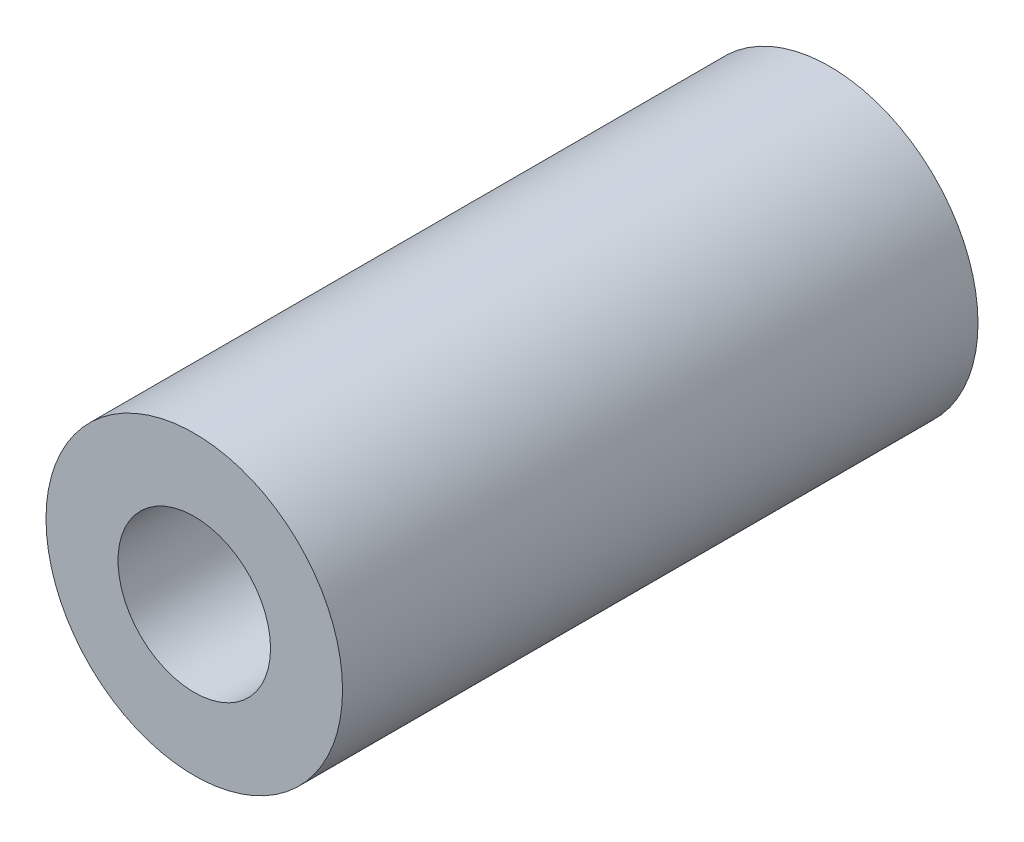
ISO-10303-21;
HEADER;
FILE_DESCRIPTION(('STEP AP214'),'2;1');
FILE_NAME('part.step','',(''),(''),'','','');
FILE_SCHEMA(('AUTOMOTIVE_DESIGN { 1 0 10303 214 1 1 1 1 }'));
ENDSEC;
DATA;
#1=APPLICATION_CONTEXT('core data for automotive mechanical design processes');
#2=APPLICATION_PROTOCOL_DEFINITION('international standard','automotive_design',2000,#1);
#3=PRODUCT_CONTEXT('',#1,'mechanical');
#4=PRODUCT('Part','Part','',(#3));
#5=PRODUCT_RELATED_PRODUCT_CATEGORY('part','',(#4));
#6=PRODUCT_DEFINITION_FORMATION('','',#4);
#7=PRODUCT_DEFINITION_CONTEXT('part definition',#1,'design');
#8=PRODUCT_DEFINITION('design','',#6,#7);
#9=PRODUCT_DEFINITION_SHAPE('','',#8);
#10=(LENGTH_UNIT() NAMED_UNIT(*) SI_UNIT(.MILLI.,.METRE.));
#11=(NAMED_UNIT(*) PLANE_ANGLE_UNIT() SI_UNIT($,.RADIAN.));
#12=(NAMED_UNIT(*) SI_UNIT($,.STERADIAN.) SOLID_ANGLE_UNIT());
#13=UNCERTAINTY_MEASURE_WITH_UNIT(LENGTH_MEASURE(1.E-05),#10,'distance_accuracy_value','');
#14=(GEOMETRIC_REPRESENTATION_CONTEXT(3) GLOBAL_UNCERTAINTY_ASSIGNED_CONTEXT((#13)) GLOBAL_UNIT_ASSIGNED_CONTEXT((#10,
#11,#12)) REPRESENTATION_CONTEXT('',''));
#15=CARTESIAN_POINT('',(0.,0.,0.));
#16=DIRECTION('',(0.,0.,1.));
#17=DIRECTION('',(1.,0.,0.));
#18=AXIS2_PLACEMENT_3D('',#15,#16,#17);
#19=CARTESIAN_POINT('',(0.,0.,15.));
#20=DIRECTION('',(0.,0.,1.));
#21=DIRECTION('',(1.,0.,0.));
#22=AXIS2_PLACEMENT_3D('',#19,#20,#21);
#23=PLANE('',#22);
#24=CARTESIAN_POINT('',(0.,0.,15.));
#25=DIRECTION('',(0.,0.,1.));
#26=DIRECTION('',(1.,0.,0.));
#27=AXIS2_PLACEMENT_3D('',#24,#25,#26);
#28=CIRCLE('',#27,3.5);
#29=CARTESIAN_POINT('',(3.5,0.,15.));
#30=VERTEX_POINT('',#29);
#31=EDGE_CURVE('E10',#30,#30,#28,.T.);
#32=ORIENTED_EDGE('',*,*,#31,.T.);
#33=EDGE_LOOP('',(#32));
#34=FACE_BOUND('',#33,.T.);
#35=CARTESIAN_POINT('',(0.,0.,15.));
#36=DIRECTION('',(0.,0.,1.));
#37=DIRECTION('',(1.,0.,0.));
#38=AXIS2_PLACEMENT_3D('',#35,#36,#37);
#39=CIRCLE('',#38,1.8);
#40=CARTESIAN_POINT('',(1.8,0.,15.));
#41=VERTEX_POINT('',#40);
#42=EDGE_CURVE('E42',#41,#41,#39,.T.);
#43=ORIENTED_EDGE('',*,*,#42,.F.);
#44=EDGE_LOOP('',(#43));
#45=FACE_BOUND('',#44,.T.);
#46=ADVANCED_FACE('F31',(#34,#45),#23,.T.);
#47=CARTESIAN_POINT('',(0.,0.,0.));
#48=DIRECTION('',(0.,0.,1.));
#49=DIRECTION('',(1.,0.,0.));
#50=AXIS2_PLACEMENT_3D('',#47,#48,#49);
#51=PLANE('',#50);
#52=CARTESIAN_POINT('',(0.,0.,0.));
#53=DIRECTION('',(0.,0.,1.));
#54=DIRECTION('',(1.,0.,0.));
#55=AXIS2_PLACEMENT_3D('',#52,#53,#54);
#56=CIRCLE('',#55,3.5);
#57=CARTESIAN_POINT('',(3.5,0.,0.));
#58=VERTEX_POINT('',#57);
#59=EDGE_CURVE('E35',#58,#58,#56,.T.);
#60=ORIENTED_EDGE('',*,*,#59,.F.);
#61=EDGE_LOOP('',(#60));
#62=FACE_BOUND('',#61,.T.);
#63=CARTESIAN_POINT('',(0.,0.,0.));
#64=DIRECTION('',(0.,0.,1.));
#65=DIRECTION('',(1.,0.,0.));
#66=AXIS2_PLACEMENT_3D('',#63,#64,#65);
#67=CIRCLE('',#66,1.8);
#68=CARTESIAN_POINT('',(1.8,0.,0.));
#69=VERTEX_POINT('',#68);
#70=EDGE_CURVE('E44',#69,#69,#67,.T.);
#71=ORIENTED_EDGE('',*,*,#70,.T.);
#72=EDGE_LOOP('',(#71));
#73=FACE_BOUND('',#72,.T.);
#74=ADVANCED_FACE('F54',(#62,#73),#51,.F.);
#75=CARTESIAN_POINT('',(0.,0.,15.));
#76=DIRECTION('',(0.,0.,-1.));
#77=DIRECTION('',(-1.,0.,0.));
#78=AXIS2_PLACEMENT_3D('',#75,#76,#77);
#79=CYLINDRICAL_SURFACE('',#78,3.5);
#80=ORIENTED_EDGE('',*,*,#31,.F.);
#81=EDGE_LOOP('',(#80));
#82=FACE_BOUND('',#81,.T.);
#83=ORIENTED_EDGE('',*,*,#59,.T.);
#84=EDGE_LOOP('',(#83));
#85=FACE_BOUND('',#84,.T.);
#86=ADVANCED_FACE('F33',(#82,#85),#79,.T.);
#87=CARTESIAN_POINT('',(0.,0.,15.));
#88=DIRECTION('',(0.,0.,-1.));
#89=DIRECTION('',(-1.,0.,0.));
#90=AXIS2_PLACEMENT_3D('',#87,#88,#89);
#91=CYLINDRICAL_SURFACE('',#90,1.8);
#92=ORIENTED_EDGE('',*,*,#42,.T.);
#93=EDGE_LOOP('',(#92));
#94=FACE_BOUND('',#93,.T.);
#95=ORIENTED_EDGE('',*,*,#70,.F.);
#96=EDGE_LOOP('',(#95));
#97=FACE_BOUND('',#96,.T.);
#98=ADVANCED_FACE('F50',(#94,#97),#91,.F.);
#99=CLOSED_SHELL('',(#46,#74,#86,#98));
#100=MANIFOLD_SOLID_BREP('B2',#99);
#101=ADVANCED_BREP_SHAPE_REPRESENTATION('',(#18,#100),#14);
#102=SHAPE_DEFINITION_REPRESENTATION(#9,#101);
ENDSEC;
END-ISO-10303-21;
